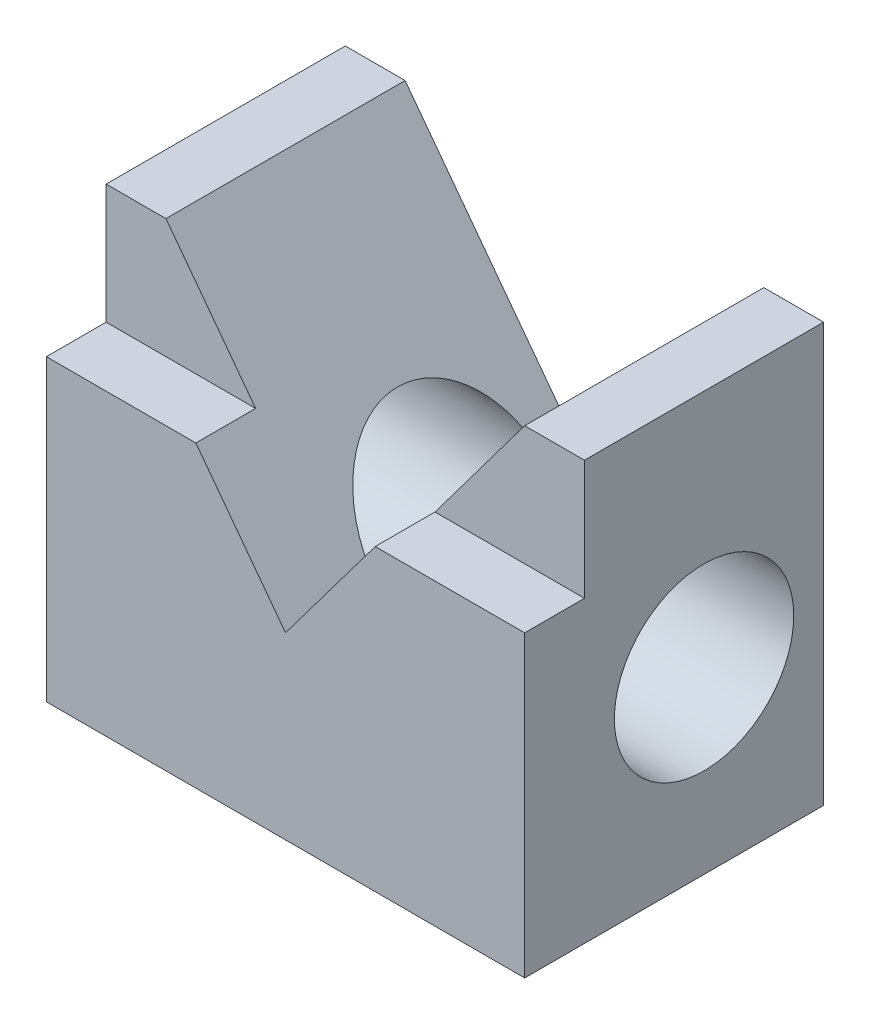
ISO-10303-21;
HEADER;
FILE_DESCRIPTION(('STEP AP214'),'2;1');
FILE_NAME('part.step','',(''),(''),'','','');
FILE_SCHEMA(('AUTOMOTIVE_DESIGN { 1 0 10303 214 1 1 1 1 }'));
ENDSEC;
DATA;
#1=APPLICATION_CONTEXT('core data for automotive mechanical design processes');
#2=APPLICATION_PROTOCOL_DEFINITION('international standard','automotive_design',2000,#1);
#3=PRODUCT_CONTEXT('',#1,'mechanical');
#4=PRODUCT('Part','Part','',(#3));
#5=PRODUCT_RELATED_PRODUCT_CATEGORY('part','',(#4));
#6=PRODUCT_DEFINITION_FORMATION('','',#4);
#7=PRODUCT_DEFINITION_CONTEXT('part definition',#1,'design');
#8=PRODUCT_DEFINITION('design','',#6,#7);
#9=PRODUCT_DEFINITION_SHAPE('','',#8);
#10=(LENGTH_UNIT() NAMED_UNIT(*) SI_UNIT(.MILLI.,.METRE.));
#11=(NAMED_UNIT(*) PLANE_ANGLE_UNIT() SI_UNIT($,.RADIAN.));
#12=(NAMED_UNIT(*) SI_UNIT($,.STERADIAN.) SOLID_ANGLE_UNIT());
#13=UNCERTAINTY_MEASURE_WITH_UNIT(LENGTH_MEASURE(1.E-05),#10,'distance_accuracy_value','');
#14=(GEOMETRIC_REPRESENTATION_CONTEXT(3) GLOBAL_UNCERTAINTY_ASSIGNED_CONTEXT((#13)) GLOBAL_UNIT_ASSIGNED_CONTEXT((#10,
#11,#12)) REPRESENTATION_CONTEXT('',''));
#15=CARTESIAN_POINT('',(0.,0.,0.));
#16=DIRECTION('',(0.,0.,1.));
#17=DIRECTION('',(1.,0.,0.));
#18=AXIS2_PLACEMENT_3D('',#15,#16,#17);
#19=CARTESIAN_POINT('',(88.9,88.9,63.5));
#20=DIRECTION('',(0.,-1.,0.));
#21=DIRECTION('',(0.,0.,-1.));
#22=AXIS2_PLACEMENT_3D('',#19,#20,#21);
#23=PLANE('',#22);
#24=DIRECTION('',(-1.,0.,0.));
#25=VECTOR('',#24,1.);
#26=CARTESIAN_POINT('',(101.6,88.9,50.8));
#27=LINE('',#26,#25);
#28=CARTESIAN_POINT('',(101.6,88.9,50.8));
#29=VERTEX_POINT('',#28);
#30=CARTESIAN_POINT('',(88.9,88.9,50.8));
#31=VERTEX_POINT('',#30);
#32=EDGE_CURVE('E172',#29,#31,#27,.T.);
#33=ORIENTED_EDGE('',*,*,#32,.F.);
#34=DIRECTION('',(0.,0.,-1.));
#35=VECTOR('',#34,1.);
#36=CARTESIAN_POINT('',(101.6,88.9,63.5));
#37=LINE('',#36,#35);
#38=CARTESIAN_POINT('',(101.6,88.9,0.));
#39=VERTEX_POINT('',#38);
#40=EDGE_CURVE('E48',#29,#39,#37,.T.);
#41=ORIENTED_EDGE('',*,*,#40,.T.);
#42=DIRECTION('',(-1.,0.,0.));
#43=VECTOR('',#42,1.);
#44=CARTESIAN_POINT('',(88.9,88.9,0.));
#45=LINE('',#44,#43);
#46=CARTESIAN_POINT('',(88.9,88.9,0.));
#47=VERTEX_POINT('',#46);
#48=EDGE_CURVE('E223',#39,#47,#45,.T.);
#49=ORIENTED_EDGE('',*,*,#48,.T.);
#50=DIRECTION('',(0.,0.,-1.));
#51=VECTOR('',#50,1.);
#52=CARTESIAN_POINT('',(88.9,88.9,63.5));
#53=LINE('',#52,#51);
#54=EDGE_CURVE('E255',#31,#47,#53,.T.);
#55=ORIENTED_EDGE('',*,*,#54,.F.);
#56=EDGE_LOOP('',(#33,#41,#49,#55));
#57=FACE_BOUND('',#56,.T.);
#58=ADVANCED_FACE('F39',(#57),#23,.F.);
#59=CARTESIAN_POINT('',(101.6,0.,63.5));
#60=DIRECTION('',(0.,1.,0.));
#61=DIRECTION('',(-1.,0.,0.));
#62=AXIS2_PLACEMENT_3D('',#59,#60,#61);
#63=PLANE('',#62);
#64=DIRECTION('',(1.,0.,0.));
#65=VECTOR('',#64,1.);
#66=CARTESIAN_POINT('',(101.6,0.,0.));
#67=LINE('',#66,#65);
#68=CARTESIAN_POINT('',(0.,0.,0.));
#69=VERTEX_POINT('',#68);
#70=CARTESIAN_POINT('',(101.6,0.,0.));
#71=VERTEX_POINT('',#70);
#72=EDGE_CURVE('E196',#69,#71,#67,.T.);
#73=ORIENTED_EDGE('',*,*,#72,.T.);
#74=DIRECTION('',(0.,0.,-1.));
#75=VECTOR('',#74,1.);
#76=CARTESIAN_POINT('',(101.6,0.,63.5));
#77=LINE('',#76,#75);
#78=CARTESIAN_POINT('',(101.6,0.,63.5));
#79=VERTEX_POINT('',#78);
#80=EDGE_CURVE('E11',#79,#71,#77,.T.);
#81=ORIENTED_EDGE('',*,*,#80,.F.);
#82=DIRECTION('',(1.,0.,0.));
#83=VECTOR('',#82,1.);
#84=CARTESIAN_POINT('',(101.6,0.,63.5));
#85=LINE('',#84,#83);
#86=CARTESIAN_POINT('',(0.,0.,63.5));
#87=VERTEX_POINT('',#86);
#88=EDGE_CURVE('E197',#87,#79,#85,.T.);
#89=ORIENTED_EDGE('',*,*,#88,.F.);
#90=DIRECTION('',(0.,0.,-1.));
#91=VECTOR('',#90,1.);
#92=CARTESIAN_POINT('',(0.,0.,63.5));
#93=LINE('',#92,#91);
#94=EDGE_CURVE('E215',#87,#69,#93,.T.);
#95=ORIENTED_EDGE('',*,*,#94,.T.);
#96=EDGE_LOOP('',(#73,#81,#89,#95));
#97=FACE_BOUND('',#96,.T.);
#98=ADVANCED_FACE('F41',(#97),#63,.F.);
#99=CARTESIAN_POINT('',(101.6,88.9,63.5));
#100=DIRECTION('',(-1.,0.,0.));
#101=DIRECTION('',(0.,-1.,0.));
#102=AXIS2_PLACEMENT_3D('',#99,#100,#101);
#103=PLANE('',#102);
#104=CARTESIAN_POINT('',(101.6,38.1,25.4));
#105=DIRECTION('',(1.,0.,0.));
#106=DIRECTION('',(0.,0.,-1.));
#107=AXIS2_PLACEMENT_3D('',#104,#105,#106);
#108=CIRCLE('',#107,19.05);
#109=CARTESIAN_POINT('',(101.6,38.1,6.35));
#110=VERTEX_POINT('',#109);
#111=EDGE_CURVE('E183',#110,#110,#108,.T.);
#112=ORIENTED_EDGE('',*,*,#111,.F.);
#113=EDGE_LOOP('',(#112));
#114=FACE_BOUND('',#113,.T.);
#115=DIRECTION('',(0.,1.,0.));
#116=VECTOR('',#115,1.);
#117=CARTESIAN_POINT('',(101.6,63.5,50.8));
#118=LINE('',#117,#116);
#119=CARTESIAN_POINT('',(101.6,63.5,50.8));
#120=VERTEX_POINT('',#119);
#121=EDGE_CURVE('E169',#120,#29,#118,.T.);
#122=ORIENTED_EDGE('',*,*,#121,.F.);
#123=DIRECTION('',(0.,0.,1.));
#124=VECTOR('',#123,1.);
#125=CARTESIAN_POINT('',(101.6,63.5,50.8));
#126=LINE('',#125,#124);
#127=CARTESIAN_POINT('',(101.6,63.5,63.5));
#128=VERTEX_POINT('',#127);
#129=EDGE_CURVE('E177',#120,#128,#126,.T.);
#130=ORIENTED_EDGE('',*,*,#129,.T.);
#131=DIRECTION('',(0.,1.,0.));
#132=VECTOR('',#131,1.);
#133=CARTESIAN_POINT('',(101.6,88.9,63.5));
#134=LINE('',#133,#132);
#135=EDGE_CURVE('E201',#79,#128,#134,.T.);
#136=ORIENTED_EDGE('',*,*,#135,.F.);
#137=ORIENTED_EDGE('',*,*,#80,.T.);
#138=DIRECTION('',(0.,1.,0.));
#139=VECTOR('',#138,1.);
#140=CARTESIAN_POINT('',(101.6,88.9,0.));
#141=LINE('',#140,#139);
#142=EDGE_CURVE('E219',#71,#39,#141,.T.);
#143=ORIENTED_EDGE('',*,*,#142,.T.);
#144=ORIENTED_EDGE('',*,*,#40,.F.);
#145=EDGE_LOOP('',(#122,#130,#136,#137,#143,#144));
#146=FACE_BOUND('',#145,.T.);
#147=ADVANCED_FACE('F266',(#114,#146),#103,.F.);
#148=CARTESIAN_POINT('',(50.8,38.1,63.5));
#149=DIRECTION('',(0.8,-0.6,0.));
#150=DIRECTION('',(0.6,0.8,0.));
#151=AXIS2_PLACEMENT_3D('',#148,#149,#150);
#152=PLANE('',#151);
#153=DIRECTION('',(-0.6,-0.8,0.));
#154=VECTOR('',#153,1.);
#155=CARTESIAN_POINT('',(50.8,38.1,63.5));
#156=LINE('',#155,#154);
#157=CARTESIAN_POINT('',(69.85,63.5,63.5));
#158=VERTEX_POINT('',#157);
#159=CARTESIAN_POINT('',(50.8,38.1,63.5));
#160=VERTEX_POINT('',#159);
#161=EDGE_CURVE('E206',#158,#160,#156,.T.);
#162=ORIENTED_EDGE('',*,*,#161,.F.);
#163=DIRECTION('',(0.,0.,1.));
#164=VECTOR('',#163,1.);
#165=CARTESIAN_POINT('',(69.85,63.5,50.8));
#166=LINE('',#165,#164);
#167=CARTESIAN_POINT('',(69.85,63.5,50.8));
#168=VERTEX_POINT('',#167);
#169=EDGE_CURVE('E63',#168,#158,#166,.T.);
#170=ORIENTED_EDGE('',*,*,#169,.F.);
#171=DIRECTION('',(-0.6,-0.8,0.));
#172=VECTOR('',#171,1.);
#173=CARTESIAN_POINT('',(88.9,88.9,50.8));
#174=LINE('',#173,#172);
#175=EDGE_CURVE('E160',#31,#168,#174,.T.);
#176=ORIENTED_EDGE('',*,*,#175,.F.);
#177=ORIENTED_EDGE('',*,*,#54,.T.);
#178=DIRECTION('',(-0.6,-0.8,0.));
#179=VECTOR('',#178,1.);
#180=CARTESIAN_POINT('',(50.8,38.1,0.));
#181=LINE('',#180,#179);
#182=CARTESIAN_POINT('',(50.8,38.1,0.));
#183=VERTEX_POINT('',#182);
#184=EDGE_CURVE('E227',#47,#183,#181,.T.);
#185=ORIENTED_EDGE('',*,*,#184,.T.);
#186=DIRECTION('',(0.,0.,-1.));
#187=VECTOR('',#186,1.);
#188=CARTESIAN_POINT('',(50.8,38.1,63.5));
#189=LINE('',#188,#187);
#190=CARTESIAN_POINT('',(50.8,38.1,6.34999999999999));
#191=VERTEX_POINT('',#190);
#192=EDGE_CURVE('E250',#191,#183,#189,.T.);
#193=ORIENTED_EDGE('',*,*,#192,.F.);
#194=CARTESIAN_POINT('',(50.8,38.1,25.4));
#195=DIRECTION('',(0.8,-0.6,0.));
#196=DIRECTION('',(-0.6,-0.8,0.));
#197=AXIS2_PLACEMENT_3D('',#194,#195,#196);
#198=ELLIPSE('',#197,23.8125,19.05);
#199=CARTESIAN_POINT('',(50.8,38.1,44.45));
#200=VERTEX_POINT('',#199);
#201=EDGE_CURVE('E193',#200,#191,#198,.F.);
#202=ORIENTED_EDGE('',*,*,#201,.F.);
#203=EDGE_CURVE('E251',#160,#200,#189,.T.);
#204=ORIENTED_EDGE('',*,*,#203,.F.);
#205=EDGE_LOOP('',(#162,#170,#176,#177,#185,#193,#202,#204));
#206=FACE_BOUND('',#205,.T.);
#207=ADVANCED_FACE('F276',(#206),#152,.F.);
#208=CARTESIAN_POINT('',(12.7,88.9,63.5));
#209=DIRECTION('',(-0.8,-0.6,0.));
#210=DIRECTION('',(0.6,-0.8,0.));
#211=AXIS2_PLACEMENT_3D('',#208,#209,#210);
#212=PLANE('',#211);
#213=DIRECTION('',(-0.6,0.8,0.));
#214=VECTOR('',#213,1.);
#215=CARTESIAN_POINT('',(12.7,88.9,50.8));
#216=LINE('',#215,#214);
#217=CARTESIAN_POINT('',(31.75,63.5,50.8));
#218=VERTEX_POINT('',#217);
#219=CARTESIAN_POINT('',(12.7,88.9,50.8));
#220=VERTEX_POINT('',#219);
#221=EDGE_CURVE('E135',#218,#220,#216,.T.);
#222=ORIENTED_EDGE('',*,*,#221,.F.);
#223=DIRECTION('',(0.,0.,1.));
#224=VECTOR('',#223,1.);
#225=CARTESIAN_POINT('',(31.75,63.5,50.8));
#226=LINE('',#225,#224);
#227=CARTESIAN_POINT('',(31.75,63.5,63.5));
#228=VERTEX_POINT('',#227);
#229=EDGE_CURVE('E131',#218,#228,#226,.T.);
#230=ORIENTED_EDGE('',*,*,#229,.T.);
#231=DIRECTION('',(-0.6,0.8,0.));
#232=VECTOR('',#231,1.);
#233=CARTESIAN_POINT('',(12.7,88.9,63.5));
#234=LINE('',#233,#232);
#235=EDGE_CURVE('E209',#160,#228,#234,.T.);
#236=ORIENTED_EDGE('',*,*,#235,.F.);
#237=ORIENTED_EDGE('',*,*,#203,.T.);
#238=CARTESIAN_POINT('',(50.8,38.1,25.4));
#239=DIRECTION('',(-0.8,-0.6,0.));
#240=DIRECTION('',(-0.6,0.8,0.));
#241=AXIS2_PLACEMENT_3D('',#238,#239,#240);
#242=ELLIPSE('',#241,23.8125,19.05);
#243=EDGE_CURVE('E187',#191,#200,#242,.F.);
#244=ORIENTED_EDGE('',*,*,#243,.F.);
#245=ORIENTED_EDGE('',*,*,#192,.T.);
#246=DIRECTION('',(-0.6,0.8,0.));
#247=VECTOR('',#246,1.);
#248=CARTESIAN_POINT('',(12.7,88.9,0.));
#249=LINE('',#248,#247);
#250=CARTESIAN_POINT('',(12.7,88.9,0.));
#251=VERTEX_POINT('',#250);
#252=EDGE_CURVE('E231',#183,#251,#249,.T.);
#253=ORIENTED_EDGE('',*,*,#252,.T.);
#254=DIRECTION('',(0.,0.,-1.));
#255=VECTOR('',#254,1.);
#256=CARTESIAN_POINT('',(12.7,88.9,63.5));
#257=LINE('',#256,#255);
#258=EDGE_CURVE('E247',#220,#251,#257,.T.);
#259=ORIENTED_EDGE('',*,*,#258,.F.);
#260=EDGE_LOOP('',(#222,#230,#236,#237,#244,#245,#253,#259));
#261=FACE_BOUND('',#260,.T.);
#262=ADVANCED_FACE('F290',(#261),#212,.F.);
#263=CARTESIAN_POINT('',(0.,88.9,63.5));
#264=DIRECTION('',(0.,-1.,0.));
#265=DIRECTION('',(0.,0.,-1.));
#266=AXIS2_PLACEMENT_3D('',#263,#264,#265);
#267=PLANE('',#266);
#268=DIRECTION('',(0.,0.,-1.));
#269=VECTOR('',#268,1.);
#270=CARTESIAN_POINT('',(0.,88.9,63.5));
#271=LINE('',#270,#269);
#272=CARTESIAN_POINT('',(0.,88.9,50.8));
#273=VERTEX_POINT('',#272);
#274=CARTESIAN_POINT('',(0.,88.9,0.));
#275=VERTEX_POINT('',#274);
#276=EDGE_CURVE('E244',#273,#275,#271,.T.);
#277=ORIENTED_EDGE('',*,*,#276,.F.);
#278=DIRECTION('',(-1.,0.,0.));
#279=VECTOR('',#278,1.);
#280=CARTESIAN_POINT('',(0.,88.9,50.8));
#281=LINE('',#280,#279);
#282=EDGE_CURVE('E141',#220,#273,#281,.T.);
#283=ORIENTED_EDGE('',*,*,#282,.F.);
#284=ORIENTED_EDGE('',*,*,#258,.T.);
#285=DIRECTION('',(-1.,0.,0.));
#286=VECTOR('',#285,1.);
#287=CARTESIAN_POINT('',(0.,88.9,0.));
#288=LINE('',#287,#286);
#289=EDGE_CURVE('E235',#251,#275,#288,.T.);
#290=ORIENTED_EDGE('',*,*,#289,.T.);
#291=EDGE_LOOP('',(#277,#283,#284,#290));
#292=FACE_BOUND('',#291,.T.);
#293=ADVANCED_FACE('F287',(#292),#267,.F.);
#294=CARTESIAN_POINT('',(0.,0.,63.5));
#295=DIRECTION('',(1.,0.,0.));
#296=DIRECTION('',(0.,0.,-1.));
#297=AXIS2_PLACEMENT_3D('',#294,#295,#296);
#298=PLANE('',#297);
#299=CARTESIAN_POINT('',(0.,38.1,25.4));
#300=DIRECTION('',(1.,0.,0.));
#301=DIRECTION('',(0.,0.,-1.));
#302=AXIS2_PLACEMENT_3D('',#299,#300,#301);
#303=CIRCLE('',#302,19.05);
#304=CARTESIAN_POINT('',(0.,38.1,6.35));
#305=VERTEX_POINT('',#304);
#306=EDGE_CURVE('E155',#305,#305,#303,.T.);
#307=ORIENTED_EDGE('',*,*,#306,.T.);
#308=EDGE_LOOP('',(#307));
#309=FACE_BOUND('',#308,.T.);
#310=DIRECTION('',(0.,-1.,0.));
#311=VECTOR('',#310,1.);
#312=CARTESIAN_POINT('',(0.,0.,63.5));
#313=LINE('',#312,#311);
#314=CARTESIAN_POINT('',(0.,63.5,63.5));
#315=VERTEX_POINT('',#314);
#316=EDGE_CURVE('E150',#315,#87,#313,.T.);
#317=ORIENTED_EDGE('',*,*,#316,.F.);
#318=DIRECTION('',(0.,0.,1.));
#319=VECTOR('',#318,1.);
#320=CARTESIAN_POINT('',(0.,63.5,50.8));
#321=LINE('',#320,#319);
#322=CARTESIAN_POINT('',(0.,63.5,50.8));
#323=VERTEX_POINT('',#322);
#324=EDGE_CURVE('E55',#323,#315,#321,.T.);
#325=ORIENTED_EDGE('',*,*,#324,.F.);
#326=DIRECTION('',(0.,-1.,0.));
#327=VECTOR('',#326,1.);
#328=CARTESIAN_POINT('',(0.,63.5,50.8));
#329=LINE('',#328,#327);
#330=EDGE_CURVE('E136',#273,#323,#329,.T.);
#331=ORIENTED_EDGE('',*,*,#330,.F.);
#332=ORIENTED_EDGE('',*,*,#276,.T.);
#333=DIRECTION('',(0.,-1.,0.));
#334=VECTOR('',#333,1.);
#335=CARTESIAN_POINT('',(0.,0.,0.));
#336=LINE('',#335,#334);
#337=EDGE_CURVE('E202',#275,#69,#336,.T.);
#338=ORIENTED_EDGE('',*,*,#337,.T.);
#339=ORIENTED_EDGE('',*,*,#94,.F.);
#340=EDGE_LOOP('',(#317,#325,#331,#332,#338,#339));
#341=FACE_BOUND('',#340,.T.);
#342=ADVANCED_FACE('F148',(#309,#341),#298,.F.);
#343=CARTESIAN_POINT('',(0.,0.,63.5));
#344=DIRECTION('',(0.,0.,-1.));
#345=DIRECTION('',(-1.,0.,0.));
#346=AXIS2_PLACEMENT_3D('',#343,#344,#345);
#347=PLANE('',#346);
#348=ORIENTED_EDGE('',*,*,#235,.T.);
#349=DIRECTION('',(1.,0.,0.));
#350=VECTOR('',#349,1.);
#351=CARTESIAN_POINT('',(0.,63.5,63.5));
#352=LINE('',#351,#350);
#353=EDGE_CURVE('E145',#315,#228,#352,.T.);
#354=ORIENTED_EDGE('',*,*,#353,.F.);
#355=ORIENTED_EDGE('',*,*,#316,.T.);
#356=ORIENTED_EDGE('',*,*,#88,.T.);
#357=ORIENTED_EDGE('',*,*,#135,.T.);
#358=DIRECTION('',(1.,0.,0.));
#359=VECTOR('',#358,1.);
#360=CARTESIAN_POINT('',(69.85,63.5,63.5));
#361=LINE('',#360,#359);
#362=EDGE_CURVE('E165',#158,#128,#361,.T.);
#363=ORIENTED_EDGE('',*,*,#362,.F.);
#364=ORIENTED_EDGE('',*,*,#161,.T.);
#365=EDGE_LOOP('',(#348,#354,#355,#356,#357,#363,#364));
#366=FACE_BOUND('',#365,.T.);
#367=ADVANCED_FACE('F282',(#366),#347,.F.);
#368=CARTESIAN_POINT('',(0.,0.,0.));
#369=DIRECTION('',(0.,0.,-1.));
#370=DIRECTION('',(-1.,0.,0.));
#371=AXIS2_PLACEMENT_3D('',#368,#369,#370);
#372=PLANE('',#371);
#373=ORIENTED_EDGE('',*,*,#72,.F.);
#374=ORIENTED_EDGE('',*,*,#337,.F.);
#375=ORIENTED_EDGE('',*,*,#289,.F.);
#376=ORIENTED_EDGE('',*,*,#252,.F.);
#377=ORIENTED_EDGE('',*,*,#184,.F.);
#378=ORIENTED_EDGE('',*,*,#48,.F.);
#379=ORIENTED_EDGE('',*,*,#142,.F.);
#380=EDGE_LOOP('',(#373,#374,#375,#376,#377,#378,#379));
#381=FACE_BOUND('',#380,.T.);
#382=ADVANCED_FACE('F270',(#381),#372,.T.);
#383=CARTESIAN_POINT('',(101.6,38.1,25.4));
#384=DIRECTION('',(-1.,0.,0.));
#385=DIRECTION('',(0.,0.,1.));
#386=AXIS2_PLACEMENT_3D('',#383,#384,#385);
#387=CYLINDRICAL_SURFACE('',#386,19.05);
#388=ORIENTED_EDGE('',*,*,#306,.F.);
#389=EDGE_LOOP('',(#388));
#390=FACE_BOUND('',#389,.T.);
#391=ORIENTED_EDGE('',*,*,#111,.T.);
#392=EDGE_LOOP('',(#391));
#393=FACE_BOUND('',#392,.T.);
#394=ORIENTED_EDGE('',*,*,#201,.T.);
#395=ORIENTED_EDGE('',*,*,#243,.T.);
#396=EDGE_LOOP('',(#394,#395));
#397=FACE_BOUND('',#396,.T.);
#398=ADVANCED_FACE('F296',(#390,#393,#397),#387,.F.);
#399=CARTESIAN_POINT('',(69.85,63.5,50.8));
#400=DIRECTION('',(0.,-1.,0.));
#401=DIRECTION('',(0.,0.,-1.));
#402=AXIS2_PLACEMENT_3D('',#399,#400,#401);
#403=PLANE('',#402);
#404=ORIENTED_EDGE('',*,*,#362,.T.);
#405=ORIENTED_EDGE('',*,*,#129,.F.);
#406=DIRECTION('',(1.,0.,0.));
#407=VECTOR('',#406,1.);
#408=CARTESIAN_POINT('',(69.85,63.5,50.8));
#409=LINE('',#408,#407);
#410=EDGE_CURVE('E164',#168,#120,#409,.T.);
#411=ORIENTED_EDGE('',*,*,#410,.F.);
#412=ORIENTED_EDGE('',*,*,#169,.T.);
#413=EDGE_LOOP('',(#404,#405,#411,#412));
#414=FACE_BOUND('',#413,.T.);
#415=ADVANCED_FACE('F301',(#414),#403,.F.);
#416=CARTESIAN_POINT('',(0.,0.,50.8));
#417=DIRECTION('',(0.,0.,1.));
#418=DIRECTION('',(1.,0.,0.));
#419=AXIS2_PLACEMENT_3D('',#416,#417,#418);
#420=PLANE('',#419);
#421=ORIENTED_EDGE('',*,*,#175,.T.);
#422=ORIENTED_EDGE('',*,*,#410,.T.);
#423=ORIENTED_EDGE('',*,*,#121,.T.);
#424=ORIENTED_EDGE('',*,*,#32,.T.);
#425=EDGE_LOOP('',(#421,#422,#423,#424));
#426=FACE_BOUND('',#425,.T.);
#427=ADVANCED_FACE('F280',(#426),#420,.T.);
#428=CARTESIAN_POINT('',(0.,63.5,50.8));
#429=DIRECTION('',(0.,-1.,0.));
#430=DIRECTION('',(0.,0.,-1.));
#431=AXIS2_PLACEMENT_3D('',#428,#429,#430);
#432=PLANE('',#431);
#433=ORIENTED_EDGE('',*,*,#353,.T.);
#434=ORIENTED_EDGE('',*,*,#229,.F.);
#435=DIRECTION('',(1.,0.,0.));
#436=VECTOR('',#435,1.);
#437=CARTESIAN_POINT('',(0.,63.5,50.8));
#438=LINE('',#437,#436);
#439=EDGE_CURVE('E127',#323,#218,#438,.T.);
#440=ORIENTED_EDGE('',*,*,#439,.F.);
#441=ORIENTED_EDGE('',*,*,#324,.T.);
#442=EDGE_LOOP('',(#433,#434,#440,#441));
#443=FACE_BOUND('',#442,.T.);
#444=ADVANCED_FACE('F129',(#443),#432,.F.);
#445=CARTESIAN_POINT('',(0.,0.,50.8));
#446=DIRECTION('',(0.,0.,-1.));
#447=DIRECTION('',(-1.,0.,0.));
#448=AXIS2_PLACEMENT_3D('',#445,#446,#447);
#449=PLANE('',#448);
#450=ORIENTED_EDGE('',*,*,#330,.T.);
#451=ORIENTED_EDGE('',*,*,#439,.T.);
#452=ORIENTED_EDGE('',*,*,#221,.T.);
#453=ORIENTED_EDGE('',*,*,#282,.T.);
#454=EDGE_LOOP('',(#450,#451,#452,#453));
#455=FACE_BOUND('',#454,.T.);
#456=ADVANCED_FACE('F139',(#455),#449,.F.);
#457=CLOSED_SHELL('',(#58,#98,#147,#207,#262,#293,#342,#367,#382,#398,#415,#427,#444,#456));
#458=MANIFOLD_SOLID_BREP('B2',#457);
#459=ADVANCED_BREP_SHAPE_REPRESENTATION('',(#18,#458),#14);
#460=SHAPE_DEFINITION_REPRESENTATION(#9,#459);
ENDSEC;
END-ISO-10303-21;
